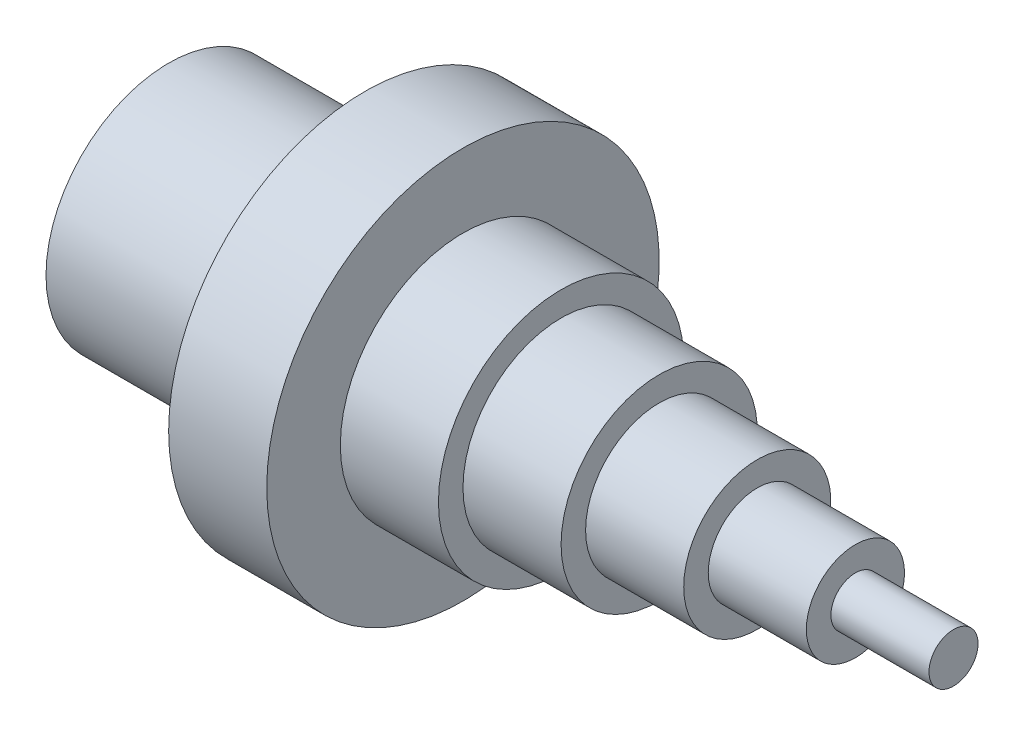
ISO-10303-21;
HEADER;
FILE_DESCRIPTION(('STEP AP214'),'2;1');
FILE_NAME('part.step','',(''),(''),'','','');
FILE_SCHEMA(('AUTOMOTIVE_DESIGN { 1 0 10303 214 1 1 1 1 }'));
ENDSEC;
DATA;
#1=APPLICATION_CONTEXT('core data for automotive mechanical design processes');
#2=APPLICATION_PROTOCOL_DEFINITION('international standard','automotive_design',2000,#1);
#3=PRODUCT_CONTEXT('',#1,'mechanical');
#4=PRODUCT('Part','Part','',(#3));
#5=PRODUCT_RELATED_PRODUCT_CATEGORY('part','',(#4));
#6=PRODUCT_DEFINITION_FORMATION('','',#4);
#7=PRODUCT_DEFINITION_CONTEXT('part definition',#1,'design');
#8=PRODUCT_DEFINITION('design','',#6,#7);
#9=PRODUCT_DEFINITION_SHAPE('','',#8);
#10=(LENGTH_UNIT() NAMED_UNIT(*) SI_UNIT(.MILLI.,.METRE.));
#11=(NAMED_UNIT(*) PLANE_ANGLE_UNIT() SI_UNIT($,.RADIAN.));
#12=(NAMED_UNIT(*) SI_UNIT($,.STERADIAN.) SOLID_ANGLE_UNIT());
#13=UNCERTAINTY_MEASURE_WITH_UNIT(LENGTH_MEASURE(1.E-05),#10,'distance_accuracy_value','');
#14=(GEOMETRIC_REPRESENTATION_CONTEXT(3) GLOBAL_UNCERTAINTY_ASSIGNED_CONTEXT((#13)) GLOBAL_UNIT_ASSIGNED_CONTEXT((#10,
#11,#12)) REPRESENTATION_CONTEXT('',''));
#15=CARTESIAN_POINT('',(0.,0.,0.));
#16=DIRECTION('',(0.,0.,1.));
#17=DIRECTION('',(1.,0.,0.));
#18=AXIS2_PLACEMENT_3D('',#15,#16,#17);
#19=CARTESIAN_POINT('',(0.,0.,0.));
#20=DIRECTION('',(1.,0.,0.));
#21=DIRECTION('',(0.,0.,-1.));
#22=AXIS2_PLACEMENT_3D('',#19,#20,#21);
#23=PLANE('',#22);
#24=CARTESIAN_POINT('',(0.,0.,0.));
#25=DIRECTION('',(-1.,0.,0.));
#26=DIRECTION('',(0.,0.,1.));
#27=AXIS2_PLACEMENT_3D('',#24,#25,#26);
#28=CIRCLE('',#27,25.);
#29=CARTESIAN_POINT('',(0.,0.,25.));
#30=VERTEX_POINT('',#29);
#31=EDGE_CURVE('E10',#30,#30,#28,.T.);
#32=ORIENTED_EDGE('',*,*,#31,.T.);
#33=EDGE_LOOP('',(#32));
#34=FACE_BOUND('',#33,.T.);
#35=ADVANCED_FACE('F31',(#34),#23,.F.);
#36=CARTESIAN_POINT('',(0.,0.,0.));
#37=DIRECTION('',(-1.,0.,0.));
#38=DIRECTION('',(0.,0.,1.));
#39=AXIS2_PLACEMENT_3D('',#36,#37,#38);
#40=CYLINDRICAL_SURFACE('',#39,25.);
#41=ORIENTED_EDGE('',*,*,#31,.F.);
#42=EDGE_LOOP('',(#41));
#43=FACE_BOUND('',#42,.T.);
#44=CARTESIAN_POINT('',(40.,0.,0.));
#45=DIRECTION('',(-1.,0.,0.));
#46=DIRECTION('',(0.,0.,1.));
#47=AXIS2_PLACEMENT_3D('',#44,#45,#46);
#48=CIRCLE('',#47,25.);
#49=CARTESIAN_POINT('',(40.,0.,25.));
#50=VERTEX_POINT('',#49);
#51=EDGE_CURVE('E37',#50,#50,#48,.T.);
#52=ORIENTED_EDGE('',*,*,#51,.T.);
#53=EDGE_LOOP('',(#52));
#54=FACE_BOUND('',#53,.T.);
#55=ADVANCED_FACE('F93',(#43,#54),#40,.T.);
#56=CARTESIAN_POINT('',(40.,25.,0.));
#57=DIRECTION('',(1.,0.,0.));
#58=DIRECTION('',(0.,0.,-1.));
#59=AXIS2_PLACEMENT_3D('',#56,#57,#58);
#60=PLANE('',#59);
#61=ORIENTED_EDGE('',*,*,#51,.F.);
#62=EDGE_LOOP('',(#61));
#63=FACE_BOUND('',#62,.T.);
#64=CARTESIAN_POINT('',(40.,0.,0.));
#65=DIRECTION('',(-1.,0.,0.));
#66=DIRECTION('',(0.,0.,1.));
#67=AXIS2_PLACEMENT_3D('',#64,#65,#66);
#68=CIRCLE('',#67,40.);
#69=CARTESIAN_POINT('',(40.,0.,40.));
#70=VERTEX_POINT('',#69);
#71=EDGE_CURVE('E41',#70,#70,#68,.T.);
#72=ORIENTED_EDGE('',*,*,#71,.T.);
#73=EDGE_LOOP('',(#72));
#74=FACE_BOUND('',#73,.T.);
#75=ADVANCED_FACE('F97',(#63,#74),#60,.F.);
#76=CARTESIAN_POINT('',(0.,0.,0.));
#77=DIRECTION('',(-1.,0.,0.));
#78=DIRECTION('',(0.,0.,1.));
#79=AXIS2_PLACEMENT_3D('',#76,#77,#78);
#80=CYLINDRICAL_SURFACE('',#79,40.);
#81=ORIENTED_EDGE('',*,*,#71,.F.);
#82=EDGE_LOOP('',(#81));
#83=FACE_BOUND('',#82,.T.);
#84=CARTESIAN_POINT('',(60.,0.,0.));
#85=DIRECTION('',(-1.,0.,0.));
#86=DIRECTION('',(0.,0.,1.));
#87=AXIS2_PLACEMENT_3D('',#84,#85,#86);
#88=CIRCLE('',#87,40.);
#89=CARTESIAN_POINT('',(60.,0.,40.));
#90=VERTEX_POINT('',#89);
#91=EDGE_CURVE('E45',#90,#90,#88,.T.);
#92=ORIENTED_EDGE('',*,*,#91,.T.);
#93=EDGE_LOOP('',(#92));
#94=FACE_BOUND('',#93,.T.);
#95=ADVANCED_FACE('F102',(#83,#94),#80,.T.);
#96=CARTESIAN_POINT('',(60.,40.,0.));
#97=DIRECTION('',(-1.,0.,0.));
#98=DIRECTION('',(0.,0.,1.));
#99=AXIS2_PLACEMENT_3D('',#96,#97,#98);
#100=PLANE('',#99);
#101=ORIENTED_EDGE('',*,*,#91,.F.);
#102=EDGE_LOOP('',(#101));
#103=FACE_BOUND('',#102,.T.);
#104=CARTESIAN_POINT('',(60.,0.,0.));
#105=DIRECTION('',(-1.,0.,0.));
#106=DIRECTION('',(0.,0.,1.));
#107=AXIS2_PLACEMENT_3D('',#104,#105,#106);
#108=CIRCLE('',#107,25.);
#109=CARTESIAN_POINT('',(60.,0.,25.));
#110=VERTEX_POINT('',#109);
#111=EDGE_CURVE('E50',#110,#110,#108,.T.);
#112=ORIENTED_EDGE('',*,*,#111,.T.);
#113=EDGE_LOOP('',(#112));
#114=FACE_BOUND('',#113,.T.);
#115=ADVANCED_FACE('F108',(#103,#114),#100,.F.);
#116=CARTESIAN_POINT('',(0.,0.,0.));
#117=DIRECTION('',(-1.,0.,0.));
#118=DIRECTION('',(0.,0.,1.));
#119=AXIS2_PLACEMENT_3D('',#116,#117,#118);
#120=CYLINDRICAL_SURFACE('',#119,25.);
#121=ORIENTED_EDGE('',*,*,#111,.F.);
#122=EDGE_LOOP('',(#121));
#123=FACE_BOUND('',#122,.T.);
#124=CARTESIAN_POINT('',(80.,0.,0.));
#125=DIRECTION('',(-1.,0.,0.));
#126=DIRECTION('',(0.,0.,1.));
#127=AXIS2_PLACEMENT_3D('',#124,#125,#126);
#128=CIRCLE('',#127,25.);
#129=CARTESIAN_POINT('',(80.,0.,25.));
#130=VERTEX_POINT('',#129);
#131=EDGE_CURVE('E53',#130,#130,#128,.T.);
#132=ORIENTED_EDGE('',*,*,#131,.T.);
#133=EDGE_LOOP('',(#132));
#134=FACE_BOUND('',#133,.T.);
#135=ADVANCED_FACE('F112',(#123,#134),#120,.T.);
#136=CARTESIAN_POINT('',(80.,25.,0.));
#137=DIRECTION('',(-1.,0.,0.));
#138=DIRECTION('',(0.,0.,1.));
#139=AXIS2_PLACEMENT_3D('',#136,#137,#138);
#140=PLANE('',#139);
#141=ORIENTED_EDGE('',*,*,#131,.F.);
#142=EDGE_LOOP('',(#141));
#143=FACE_BOUND('',#142,.T.);
#144=CARTESIAN_POINT('',(80.,0.,0.));
#145=DIRECTION('',(-1.,0.,0.));
#146=DIRECTION('',(0.,0.,1.));
#147=AXIS2_PLACEMENT_3D('',#144,#145,#146);
#148=CIRCLE('',#147,20.);
#149=CARTESIAN_POINT('',(80.,0.,20.));
#150=VERTEX_POINT('',#149);
#151=EDGE_CURVE('E56',#150,#150,#148,.T.);
#152=ORIENTED_EDGE('',*,*,#151,.T.);
#153=EDGE_LOOP('',(#152));
#154=FACE_BOUND('',#153,.T.);
#155=ADVANCED_FACE('F116',(#143,#154),#140,.F.);
#156=CARTESIAN_POINT('',(0.,0.,0.));
#157=DIRECTION('',(-1.,0.,0.));
#158=DIRECTION('',(0.,0.,1.));
#159=AXIS2_PLACEMENT_3D('',#156,#157,#158);
#160=CYLINDRICAL_SURFACE('',#159,20.);
#161=ORIENTED_EDGE('',*,*,#151,.F.);
#162=EDGE_LOOP('',(#161));
#163=FACE_BOUND('',#162,.T.);
#164=CARTESIAN_POINT('',(100.,0.,0.));
#165=DIRECTION('',(-1.,0.,0.));
#166=DIRECTION('',(0.,0.,1.));
#167=AXIS2_PLACEMENT_3D('',#164,#165,#166);
#168=CIRCLE('',#167,20.);
#169=CARTESIAN_POINT('',(100.,0.,20.));
#170=VERTEX_POINT('',#169);
#171=EDGE_CURVE('E59',#170,#170,#168,.T.);
#172=ORIENTED_EDGE('',*,*,#171,.T.);
#173=EDGE_LOOP('',(#172));
#174=FACE_BOUND('',#173,.T.);
#175=ADVANCED_FACE('F120',(#163,#174),#160,.T.);
#176=CARTESIAN_POINT('',(100.,20.,0.));
#177=DIRECTION('',(-1.,0.,0.));
#178=DIRECTION('',(0.,0.,1.));
#179=AXIS2_PLACEMENT_3D('',#176,#177,#178);
#180=PLANE('',#179);
#181=ORIENTED_EDGE('',*,*,#171,.F.);
#182=EDGE_LOOP('',(#181));
#183=FACE_BOUND('',#182,.T.);
#184=CARTESIAN_POINT('',(100.,0.,0.));
#185=DIRECTION('',(-1.,0.,0.));
#186=DIRECTION('',(0.,0.,1.));
#187=AXIS2_PLACEMENT_3D('',#184,#185,#186);
#188=CIRCLE('',#187,15.);
#189=CARTESIAN_POINT('',(100.,0.,15.));
#190=VERTEX_POINT('',#189);
#191=EDGE_CURVE('E62',#190,#190,#188,.T.);
#192=ORIENTED_EDGE('',*,*,#191,.T.);
#193=EDGE_LOOP('',(#192));
#194=FACE_BOUND('',#193,.T.);
#195=ADVANCED_FACE('F124',(#183,#194),#180,.F.);
#196=CARTESIAN_POINT('',(0.,0.,0.));
#197=DIRECTION('',(-1.,0.,0.));
#198=DIRECTION('',(0.,0.,1.));
#199=AXIS2_PLACEMENT_3D('',#196,#197,#198);
#200=CYLINDRICAL_SURFACE('',#199,15.);
#201=ORIENTED_EDGE('',*,*,#191,.F.);
#202=EDGE_LOOP('',(#201));
#203=FACE_BOUND('',#202,.T.);
#204=CARTESIAN_POINT('',(120.,0.,0.));
#205=DIRECTION('',(-1.,0.,0.));
#206=DIRECTION('',(0.,0.,1.));
#207=AXIS2_PLACEMENT_3D('',#204,#205,#206);
#208=CIRCLE('',#207,15.);
#209=CARTESIAN_POINT('',(120.,0.,15.));
#210=VERTEX_POINT('',#209);
#211=EDGE_CURVE('E65',#210,#210,#208,.T.);
#212=ORIENTED_EDGE('',*,*,#211,.T.);
#213=EDGE_LOOP('',(#212));
#214=FACE_BOUND('',#213,.T.);
#215=ADVANCED_FACE('F128',(#203,#214),#200,.T.);
#216=CARTESIAN_POINT('',(120.,15.,0.));
#217=DIRECTION('',(-1.,0.,0.));
#218=DIRECTION('',(0.,0.,1.));
#219=AXIS2_PLACEMENT_3D('',#216,#217,#218);
#220=PLANE('',#219);
#221=ORIENTED_EDGE('',*,*,#211,.F.);
#222=EDGE_LOOP('',(#221));
#223=FACE_BOUND('',#222,.T.);
#224=CARTESIAN_POINT('',(120.,0.,0.));
#225=DIRECTION('',(-1.,0.,0.));
#226=DIRECTION('',(0.,0.,1.));
#227=AXIS2_PLACEMENT_3D('',#224,#225,#226);
#228=CIRCLE('',#227,10.);
#229=CARTESIAN_POINT('',(120.,0.,10.));
#230=VERTEX_POINT('',#229);
#231=EDGE_CURVE('E68',#230,#230,#228,.T.);
#232=ORIENTED_EDGE('',*,*,#231,.T.);
#233=EDGE_LOOP('',(#232));
#234=FACE_BOUND('',#233,.T.);
#235=ADVANCED_FACE('F132',(#223,#234),#220,.F.);
#236=CARTESIAN_POINT('',(0.,0.,0.));
#237=DIRECTION('',(-1.,0.,0.));
#238=DIRECTION('',(0.,0.,1.));
#239=AXIS2_PLACEMENT_3D('',#236,#237,#238);
#240=CYLINDRICAL_SURFACE('',#239,10.);
#241=ORIENTED_EDGE('',*,*,#231,.F.);
#242=EDGE_LOOP('',(#241));
#243=FACE_BOUND('',#242,.T.);
#244=CARTESIAN_POINT('',(140.,0.,0.));
#245=DIRECTION('',(-1.,0.,0.));
#246=DIRECTION('',(0.,0.,1.));
#247=AXIS2_PLACEMENT_3D('',#244,#245,#246);
#248=CIRCLE('',#247,10.);
#249=CARTESIAN_POINT('',(140.,0.,10.));
#250=VERTEX_POINT('',#249);
#251=EDGE_CURVE('E71',#250,#250,#248,.T.);
#252=ORIENTED_EDGE('',*,*,#251,.T.);
#253=EDGE_LOOP('',(#252));
#254=FACE_BOUND('',#253,.T.);
#255=ADVANCED_FACE('F136',(#243,#254),#240,.T.);
#256=CARTESIAN_POINT('',(140.,10.,0.));
#257=DIRECTION('',(-1.,0.,0.));
#258=DIRECTION('',(0.,0.,1.));
#259=AXIS2_PLACEMENT_3D('',#256,#257,#258);
#260=PLANE('',#259);
#261=ORIENTED_EDGE('',*,*,#251,.F.);
#262=EDGE_LOOP('',(#261));
#263=FACE_BOUND('',#262,.T.);
#264=CARTESIAN_POINT('',(140.,0.,0.));
#265=DIRECTION('',(-1.,0.,0.));
#266=DIRECTION('',(0.,0.,1.));
#267=AXIS2_PLACEMENT_3D('',#264,#265,#266);
#268=CIRCLE('',#267,5.);
#269=CARTESIAN_POINT('',(140.,0.,5.));
#270=VERTEX_POINT('',#269);
#271=EDGE_CURVE('E74',#270,#270,#268,.T.);
#272=ORIENTED_EDGE('',*,*,#271,.T.);
#273=EDGE_LOOP('',(#272));
#274=FACE_BOUND('',#273,.T.);
#275=ADVANCED_FACE('F89',(#263,#274),#260,.F.);
#276=CARTESIAN_POINT('',(0.,0.,0.));
#277=DIRECTION('',(-1.,0.,0.));
#278=DIRECTION('',(0.,0.,1.));
#279=AXIS2_PLACEMENT_3D('',#276,#277,#278);
#280=CYLINDRICAL_SURFACE('',#279,5.);
#281=ORIENTED_EDGE('',*,*,#271,.F.);
#282=EDGE_LOOP('',(#281));
#283=FACE_BOUND('',#282,.T.);
#284=CARTESIAN_POINT('',(160.,0.,0.));
#285=DIRECTION('',(-1.,0.,0.));
#286=DIRECTION('',(0.,0.,1.));
#287=AXIS2_PLACEMENT_3D('',#284,#285,#286);
#288=CIRCLE('',#287,5.);
#289=CARTESIAN_POINT('',(160.,0.,5.));
#290=VERTEX_POINT('',#289);
#291=EDGE_CURVE('E77',#290,#290,#288,.T.);
#292=ORIENTED_EDGE('',*,*,#291,.T.);
#293=EDGE_LOOP('',(#292));
#294=FACE_BOUND('',#293,.T.);
#295=ADVANCED_FACE('F81',(#283,#294),#280,.T.);
#296=CARTESIAN_POINT('',(160.,5.,0.));
#297=DIRECTION('',(-1.,0.,0.));
#298=DIRECTION('',(0.,0.,1.));
#299=AXIS2_PLACEMENT_3D('',#296,#297,#298);
#300=PLANE('',#299);
#301=ORIENTED_EDGE('',*,*,#291,.F.);
#302=EDGE_LOOP('',(#301));
#303=FACE_BOUND('',#302,.T.);
#304=ADVANCED_FACE('F83',(#303),#300,.F.);
#305=CLOSED_SHELL('',(#35,#55,#75,#95,#115,#135,#155,#175,#195,#215,#235,#255,#275,#295,#304));
#306=MANIFOLD_SOLID_BREP('B2',#305);
#307=ADVANCED_BREP_SHAPE_REPRESENTATION('',(#18,#306),#14);
#308=SHAPE_DEFINITION_REPRESENTATION(#9,#307);
ENDSEC;
END-ISO-10303-21;
